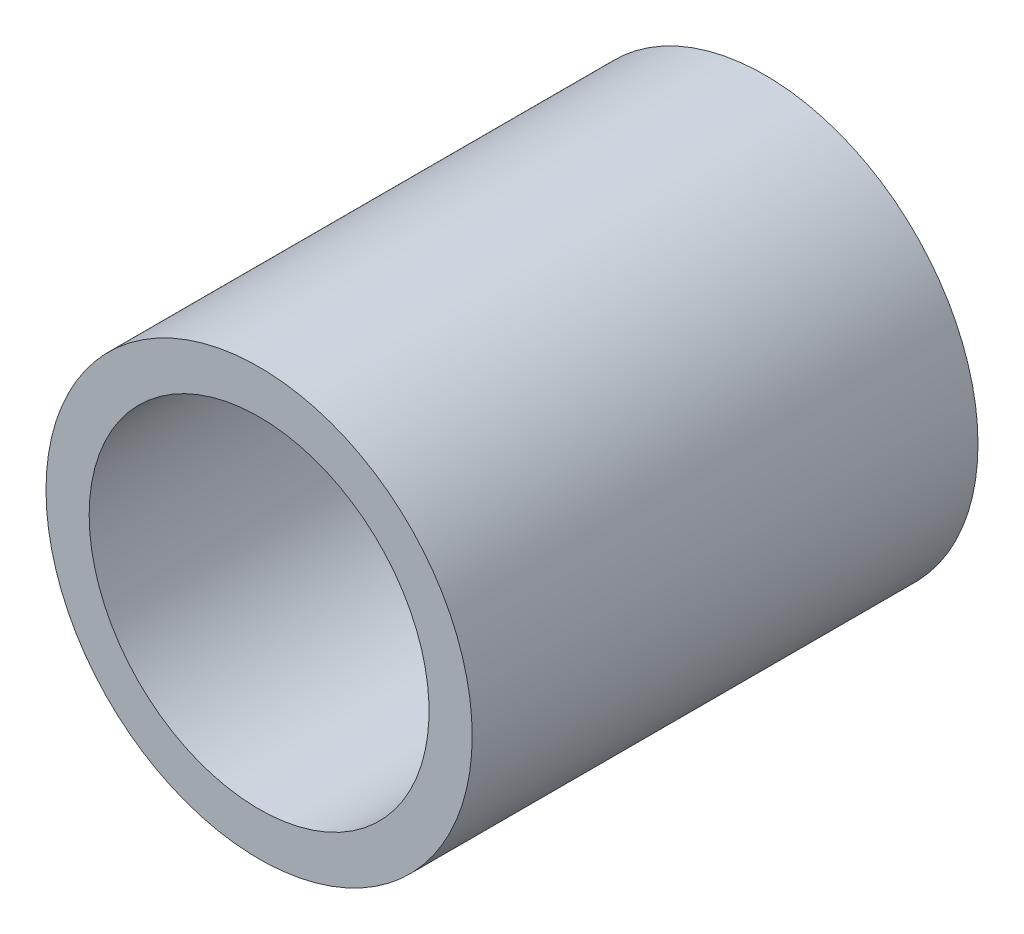
ISO-10303-21;
HEADER;
FILE_DESCRIPTION(('STEP AP214'),'2;1');
FILE_NAME('part.step','',(''),(''),'','','');
FILE_SCHEMA(('AUTOMOTIVE_DESIGN { 1 0 10303 214 1 1 1 1 }'));
ENDSEC;
DATA;
#1=APPLICATION_CONTEXT('core data for automotive mechanical design processes');
#2=APPLICATION_PROTOCOL_DEFINITION('international standard','automotive_design',2000,#1);
#3=PRODUCT_CONTEXT('',#1,'mechanical');
#4=PRODUCT('Part','Part','',(#3));
#5=PRODUCT_RELATED_PRODUCT_CATEGORY('part','',(#4));
#6=PRODUCT_DEFINITION_FORMATION('','',#4);
#7=PRODUCT_DEFINITION_CONTEXT('part definition',#1,'design');
#8=PRODUCT_DEFINITION('design','',#6,#7);
#9=PRODUCT_DEFINITION_SHAPE('','',#8);
#10=(LENGTH_UNIT() NAMED_UNIT(*) SI_UNIT(.MILLI.,.METRE.));
#11=(NAMED_UNIT(*) PLANE_ANGLE_UNIT() SI_UNIT($,.RADIAN.));
#12=(NAMED_UNIT(*) SI_UNIT($,.STERADIAN.) SOLID_ANGLE_UNIT());
#13=UNCERTAINTY_MEASURE_WITH_UNIT(LENGTH_MEASURE(1.E-05),#10,'distance_accuracy_value','');
#14=(GEOMETRIC_REPRESENTATION_CONTEXT(3) GLOBAL_UNCERTAINTY_ASSIGNED_CONTEXT((#13)) GLOBAL_UNIT_ASSIGNED_CONTEXT((#10,
#11,#12)) REPRESENTATION_CONTEXT('',''));
#15=CARTESIAN_POINT('',(0.,0.,0.));
#16=DIRECTION('',(0.,0.,1.));
#17=DIRECTION('',(1.,0.,0.));
#18=AXIS2_PLACEMENT_3D('',#15,#16,#17);
#19=CARTESIAN_POINT('',(0.,0.,4.7625));
#20=DIRECTION('',(0.,0.,1.));
#21=DIRECTION('',(1.,0.,0.));
#22=AXIS2_PLACEMENT_3D('',#19,#20,#21);
#23=PLANE('',#22);
#24=CARTESIAN_POINT('',(0.,0.,4.7625));
#25=DIRECTION('',(0.,0.,1.));
#26=DIRECTION('',(1.,0.,0.));
#27=AXIS2_PLACEMENT_3D('',#24,#25,#26);
#28=CIRCLE('',#27,4.0132);
#29=CARTESIAN_POINT('',(-4.0132,0.,4.7625));
#30=VERTEX_POINT('',#29);
#31=EDGE_CURVE('E10',#30,#30,#28,.T.);
#32=ORIENTED_EDGE('',*,*,#31,.T.);
#33=EDGE_LOOP('',(#32));
#34=FACE_BOUND('',#33,.T.);
#35=CARTESIAN_POINT('',(0.,0.,4.7625));
#36=DIRECTION('',(0.,0.,1.));
#37=DIRECTION('',(1.,0.,0.));
#38=AXIS2_PLACEMENT_3D('',#35,#36,#37);
#39=CIRCLE('',#38,3.2004);
#40=CARTESIAN_POINT('',(-3.2004,0.,4.7625));
#41=VERTEX_POINT('',#40);
#42=EDGE_CURVE('E53',#41,#41,#39,.T.);
#43=ORIENTED_EDGE('',*,*,#42,.F.);
#44=EDGE_LOOP('',(#43));
#45=FACE_BOUND('',#44,.T.);
#46=ADVANCED_FACE('F39',(#34,#45),#23,.T.);
#47=CARTESIAN_POINT('',(0.,0.,-4.7625));
#48=DIRECTION('',(0.,0.,1.));
#49=DIRECTION('',(1.,0.,0.));
#50=AXIS2_PLACEMENT_3D('',#47,#48,#49);
#51=PLANE('',#50);
#52=CARTESIAN_POINT('',(0.,0.,-4.7625));
#53=DIRECTION('',(0.,0.,1.));
#54=DIRECTION('',(1.,0.,0.));
#55=AXIS2_PLACEMENT_3D('',#52,#53,#54);
#56=CIRCLE('',#55,4.0132);
#57=CARTESIAN_POINT('',(-4.0132,0.,-4.7625));
#58=VERTEX_POINT('',#57);
#59=EDGE_CURVE('E43',#58,#58,#56,.T.);
#60=ORIENTED_EDGE('',*,*,#59,.F.);
#61=EDGE_LOOP('',(#60));
#62=FACE_BOUND('',#61,.T.);
#63=CARTESIAN_POINT('',(0.,0.,-4.7625));
#64=DIRECTION('',(0.,0.,1.));
#65=DIRECTION('',(1.,0.,0.));
#66=AXIS2_PLACEMENT_3D('',#63,#64,#65);
#67=CIRCLE('',#66,3.2004);
#68=CARTESIAN_POINT('',(-3.2004,0.,-4.7625));
#69=VERTEX_POINT('',#68);
#70=EDGE_CURVE('E55',#69,#69,#67,.T.);
#71=ORIENTED_EDGE('',*,*,#70,.T.);
#72=EDGE_LOOP('',(#71));
#73=FACE_BOUND('',#72,.T.);
#74=ADVANCED_FACE('F66',(#62,#73),#51,.F.);
#75=CARTESIAN_POINT('',(0.,0.,4.7625));
#76=DIRECTION('',(0.,0.,-1.));
#77=DIRECTION('',(-1.,0.,0.));
#78=AXIS2_PLACEMENT_3D('',#75,#76,#77);
#79=CYLINDRICAL_SURFACE('',#78,4.0132);
#80=CARTESIAN_POINT('',(-4.0132,0.,4.7625));
#81=CARTESIAN_POINT('',(-4.0132,0.,4.66328125));
#82=CARTESIAN_POINT('',(-4.0132,0.,4.5640625));
#83=CARTESIAN_POINT('',(-4.0132,0.,4.365625));
#84=CARTESIAN_POINT('',(-4.0132,0.,4.26640625));
#85=CARTESIAN_POINT('',(-4.0132,0.,4.06796875));
#86=CARTESIAN_POINT('',(-4.0132,0.,3.96875));
#87=CARTESIAN_POINT('',(-4.0132,0.,3.7703125));
#88=CARTESIAN_POINT('',(-4.0132,0.,3.67109375));
#89=CARTESIAN_POINT('',(-4.0132,0.,3.47265625));
#90=CARTESIAN_POINT('',(-4.0132,0.,3.3734375));
#91=CARTESIAN_POINT('',(-4.0132,0.,3.175));
#92=CARTESIAN_POINT('',(-4.0132,0.,3.07578125));
#93=CARTESIAN_POINT('',(-4.0132,0.,2.87734375));
#94=CARTESIAN_POINT('',(-4.0132,0.,2.778125));
#95=CARTESIAN_POINT('',(-4.0132,0.,2.5796875));
#96=CARTESIAN_POINT('',(-4.0132,0.,2.48046875));
#97=CARTESIAN_POINT('',(-4.0132,0.,2.28203125));
#98=CARTESIAN_POINT('',(-4.0132,0.,2.1828125));
#99=CARTESIAN_POINT('',(-4.0132,0.,1.984375));
#100=CARTESIAN_POINT('',(-4.0132,0.,1.88515625));
#101=CARTESIAN_POINT('',(-4.0132,0.,1.68671875));
#102=CARTESIAN_POINT('',(-4.0132,0.,1.5875));
#103=CARTESIAN_POINT('',(-4.0132,0.,1.3890625));
#104=CARTESIAN_POINT('',(-4.0132,0.,1.28984375));
#105=CARTESIAN_POINT('',(-4.0132,0.,1.09140625));
#106=CARTESIAN_POINT('',(-4.0132,0.,0.992187499999999));
#107=CARTESIAN_POINT('',(-4.0132,0.,0.79375));
#108=CARTESIAN_POINT('',(-4.0132,0.,0.69453125));
#109=CARTESIAN_POINT('',(-4.0132,0.,0.49609375));
#110=CARTESIAN_POINT('',(-4.0132,0.,0.396875));
#111=CARTESIAN_POINT('',(-4.0132,0.,0.1984375));
#112=CARTESIAN_POINT('',(-4.0132,0.,0.0992187500000001));
#113=CARTESIAN_POINT('',(-4.0132,0.,-0.0992187500000001));
#114=CARTESIAN_POINT('',(-4.0132,0.,-0.1984375));
#115=CARTESIAN_POINT('',(-4.0132,0.,-0.396875));
#116=CARTESIAN_POINT('',(-4.0132,0.,-0.49609375));
#117=CARTESIAN_POINT('',(-4.0132,0.,-0.69453125));
#118=CARTESIAN_POINT('',(-4.0132,0.,-0.793750000000001));
#119=CARTESIAN_POINT('',(-4.0132,0.,-0.992187500000001));
#120=CARTESIAN_POINT('',(-4.0132,0.,-1.09140625));
#121=CARTESIAN_POINT('',(-4.0132,0.,-1.28984375));
#122=CARTESIAN_POINT('',(-4.0132,0.,-1.3890625));
#123=CARTESIAN_POINT('',(-4.0132,0.,-1.5875));
#124=CARTESIAN_POINT('',(-4.0132,0.,-1.68671875));
#125=CARTESIAN_POINT('',(-4.0132,0.,-1.88515625));
#126=CARTESIAN_POINT('',(-4.0132,0.,-1.984375));
#127=CARTESIAN_POINT('',(-4.0132,0.,-2.1828125));
#128=CARTESIAN_POINT('',(-4.0132,0.,-2.28203125));
#129=CARTESIAN_POINT('',(-4.0132,0.,-2.48046875));
#130=CARTESIAN_POINT('',(-4.0132,0.,-2.5796875));
#131=CARTESIAN_POINT('',(-4.0132,0.,-2.778125));
#132=CARTESIAN_POINT('',(-4.0132,0.,-2.87734375));
#133=CARTESIAN_POINT('',(-4.0132,0.,-3.07578125));
#134=CARTESIAN_POINT('',(-4.0132,0.,-3.175));
#135=CARTESIAN_POINT('',(-4.0132,0.,-3.3734375));
#136=CARTESIAN_POINT('',(-4.0132,0.,-3.47265625));
#137=CARTESIAN_POINT('',(-4.0132,0.,-3.67109375));
#138=CARTESIAN_POINT('',(-4.0132,0.,-3.7703125));
#139=CARTESIAN_POINT('',(-4.0132,0.,-3.96875));
#140=CARTESIAN_POINT('',(-4.0132,0.,-4.06796875));
#141=CARTESIAN_POINT('',(-4.0132,0.,-4.26640625));
#142=CARTESIAN_POINT('',(-4.0132,0.,-4.365625));
#143=CARTESIAN_POINT('',(-4.0132,0.,-4.5640625));
#144=CARTESIAN_POINT('',(-4.0132,0.,-4.66328125));
#145=CARTESIAN_POINT('',(-4.0132,0.,-4.7625));
#146=B_SPLINE_CURVE_WITH_KNOTS('',3,(#80,#81,#82,#83,#84,#85,#86,#87,#88,#89,#90,#91,#92,#93,
#94,#95,#96,#97,#98,#99,#100,#101,#102,#103,#104,#105,#106,#107,#108,#109,#110,#111,#112,#113,
#114,#115,#116,#117,#118,#119,#120,#121,#122,#123,#124,#125,#126,#127,#128,#129,#130,#131,#132,
#133,#134,#135,#136,#137,#138,#139,#140,#141,#142,#143,#144,#145),.UNSPECIFIED.,.F.,.F.,(4,2,2,
2,2,2,2,2,2,2,2,2,2,2,2,2,2,2,2,2,2,2,2,2,2,2,2,2,2,2,2,2,4),(0.,0.29765625,0.5953125,
0.892968750000001,1.190625,1.48828125,1.7859375,2.08359375,2.38125,2.67890625,2.9765625,
3.27421875,3.571875,3.86953125,4.1671875,4.46484375,4.7625,5.06015625,5.3578125,5.65546875,
5.953125,6.25078125,6.5484375,6.84609375,7.14375,7.44140625,7.7390625,8.03671875,8.334375,
8.63203125,8.9296875,9.22734375,9.525),.UNSPECIFIED.);
#147=EDGE_CURVE('BSEAM41',#30,#58,#146,.T.);
#148=ORIENTED_EDGE('',*,*,#31,.F.);
#149=ORIENTED_EDGE('',*,*,#59,.T.);
#150=ORIENTED_EDGE('',*,*,#147,.T.);
#151=ORIENTED_EDGE('',*,*,#147,.F.);
#152=EDGE_LOOP('',(#148,#150,#149,#151));
#153=FACE_BOUND('',#152,.T.);
#154=ADVANCED_FACE('F41',(#153),#79,.T.);
#155=CARTESIAN_POINT('',(0.,0.,4.7625));
#156=DIRECTION('',(0.,0.,-1.));
#157=DIRECTION('',(-1.,0.,0.));
#158=AXIS2_PLACEMENT_3D('',#155,#156,#157);
#159=CYLINDRICAL_SURFACE('',#158,3.2004);
#160=CARTESIAN_POINT('',(-3.2004,0.,4.7625));
#161=CARTESIAN_POINT('',(-3.2004,0.,4.66328125));
#162=CARTESIAN_POINT('',(-3.2004,0.,4.5640625));
#163=CARTESIAN_POINT('',(-3.2004,0.,4.365625));
#164=CARTESIAN_POINT('',(-3.2004,0.,4.26640625));
#165=CARTESIAN_POINT('',(-3.2004,0.,4.06796875));
#166=CARTESIAN_POINT('',(-3.2004,0.,3.96875));
#167=CARTESIAN_POINT('',(-3.2004,0.,3.7703125));
#168=CARTESIAN_POINT('',(-3.2004,0.,3.67109375));
#169=CARTESIAN_POINT('',(-3.2004,0.,3.47265625));
#170=CARTESIAN_POINT('',(-3.2004,0.,3.3734375));
#171=CARTESIAN_POINT('',(-3.2004,0.,3.175));
#172=CARTESIAN_POINT('',(-3.2004,0.,3.07578125));
#173=CARTESIAN_POINT('',(-3.2004,0.,2.87734375));
#174=CARTESIAN_POINT('',(-3.2004,0.,2.778125));
#175=CARTESIAN_POINT('',(-3.2004,0.,2.5796875));
#176=CARTESIAN_POINT('',(-3.2004,0.,2.48046875));
#177=CARTESIAN_POINT('',(-3.2004,0.,2.28203125));
#178=CARTESIAN_POINT('',(-3.2004,0.,2.1828125));
#179=CARTESIAN_POINT('',(-3.2004,0.,1.984375));
#180=CARTESIAN_POINT('',(-3.2004,0.,1.88515625));
#181=CARTESIAN_POINT('',(-3.2004,0.,1.68671875));
#182=CARTESIAN_POINT('',(-3.2004,0.,1.5875));
#183=CARTESIAN_POINT('',(-3.2004,0.,1.3890625));
#184=CARTESIAN_POINT('',(-3.2004,0.,1.28984375));
#185=CARTESIAN_POINT('',(-3.2004,0.,1.09140625));
#186=CARTESIAN_POINT('',(-3.2004,0.,0.992187499999999));
#187=CARTESIAN_POINT('',(-3.2004,0.,0.79375));
#188=CARTESIAN_POINT('',(-3.2004,0.,0.69453125));
#189=CARTESIAN_POINT('',(-3.2004,0.,0.49609375));
#190=CARTESIAN_POINT('',(-3.2004,0.,0.396875));
#191=CARTESIAN_POINT('',(-3.2004,0.,0.1984375));
#192=CARTESIAN_POINT('',(-3.2004,0.,0.0992187500000001));
#193=CARTESIAN_POINT('',(-3.2004,0.,-0.0992187500000001));
#194=CARTESIAN_POINT('',(-3.2004,0.,-0.1984375));
#195=CARTESIAN_POINT('',(-3.2004,0.,-0.396875));
#196=CARTESIAN_POINT('',(-3.2004,0.,-0.49609375));
#197=CARTESIAN_POINT('',(-3.2004,0.,-0.69453125));
#198=CARTESIAN_POINT('',(-3.2004,0.,-0.793750000000001));
#199=CARTESIAN_POINT('',(-3.2004,0.,-0.992187500000001));
#200=CARTESIAN_POINT('',(-3.2004,0.,-1.09140625));
#201=CARTESIAN_POINT('',(-3.2004,0.,-1.28984375));
#202=CARTESIAN_POINT('',(-3.2004,0.,-1.3890625));
#203=CARTESIAN_POINT('',(-3.2004,0.,-1.5875));
#204=CARTESIAN_POINT('',(-3.2004,0.,-1.68671875));
#205=CARTESIAN_POINT('',(-3.2004,0.,-1.88515625));
#206=CARTESIAN_POINT('',(-3.2004,0.,-1.984375));
#207=CARTESIAN_POINT('',(-3.2004,0.,-2.1828125));
#208=CARTESIAN_POINT('',(-3.2004,0.,-2.28203125));
#209=CARTESIAN_POINT('',(-3.2004,0.,-2.48046875));
#210=CARTESIAN_POINT('',(-3.2004,0.,-2.5796875));
#211=CARTESIAN_POINT('',(-3.2004,0.,-2.778125));
#212=CARTESIAN_POINT('',(-3.2004,0.,-2.87734375));
#213=CARTESIAN_POINT('',(-3.2004,0.,-3.07578125));
#214=CARTESIAN_POINT('',(-3.2004,0.,-3.175));
#215=CARTESIAN_POINT('',(-3.2004,0.,-3.3734375));
#216=CARTESIAN_POINT('',(-3.2004,0.,-3.47265625));
#217=CARTESIAN_POINT('',(-3.2004,0.,-3.67109375));
#218=CARTESIAN_POINT('',(-3.2004,0.,-3.7703125));
#219=CARTESIAN_POINT('',(-3.2004,0.,-3.96875));
#220=CARTESIAN_POINT('',(-3.2004,0.,-4.06796875));
#221=CARTESIAN_POINT('',(-3.2004,0.,-4.26640625));
#222=CARTESIAN_POINT('',(-3.2004,0.,-4.365625));
#223=CARTESIAN_POINT('',(-3.2004,0.,-4.5640625));
#224=CARTESIAN_POINT('',(-3.2004,0.,-4.66328125));
#225=CARTESIAN_POINT('',(-3.2004,0.,-4.7625));
#226=B_SPLINE_CURVE_WITH_KNOTS('',3,(#160,#161,#162,#163,#164,#165,#166,#167,#168,#169,#170,
#171,#172,#173,#174,#175,#176,#177,#178,#179,#180,#181,#182,#183,#184,#185,#186,#187,#188,#189,
#190,#191,#192,#193,#194,#195,#196,#197,#198,#199,#200,#201,#202,#203,#204,#205,#206,#207,#208,
#209,#210,#211,#212,#213,#214,#215,#216,#217,#218,#219,#220,#221,#222,#223,#224,#225),
.UNSPECIFIED.,.F.,.F.,(4,2,2,2,2,2,2,2,2,2,2,2,2,2,2,2,2,2,2,2,2,2,2,2,2,2,2,2,2,2,2,2,4),(0.,
0.29765625,0.5953125,0.892968750000001,1.190625,1.48828125,1.7859375,2.08359375,2.38125,
2.67890625,2.9765625,3.27421875,3.571875,3.86953125,4.1671875,4.46484375,4.7625,5.06015625,
5.3578125,5.65546875,5.953125,6.25078125,6.5484375,6.84609375,7.14375,7.44140625,7.7390625,
8.03671875,8.334375,8.63203125,8.9296875,9.22734375,9.525),.UNSPECIFIED.);
#227=EDGE_CURVE('BSEAM62',#41,#69,#226,.T.);
#228=ORIENTED_EDGE('',*,*,#42,.T.);
#229=ORIENTED_EDGE('',*,*,#70,.F.);
#230=ORIENTED_EDGE('',*,*,#227,.T.);
#231=ORIENTED_EDGE('',*,*,#227,.F.);
#232=EDGE_LOOP('',(#228,#230,#229,#231));
#233=FACE_BOUND('',#232,.T.);
#234=ADVANCED_FACE('F62',(#233),#159,.F.);
#235=CLOSED_SHELL('',(#46,#74,#154,#234));
#236=MANIFOLD_SOLID_BREP('B2',#235);
#237=ADVANCED_BREP_SHAPE_REPRESENTATION('',(#18,#236),#14);
#238=SHAPE_DEFINITION_REPRESENTATION(#9,#237);
ENDSEC;
END-ISO-10303-21;
